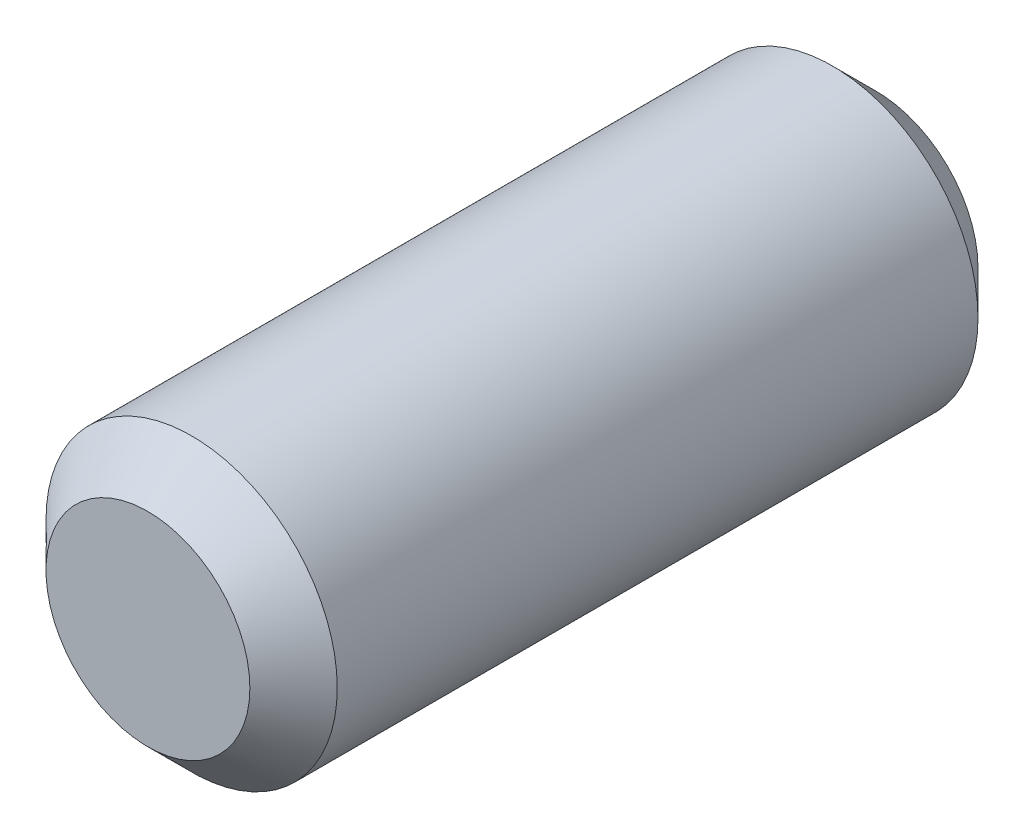
ISO-10303-21;
HEADER;
FILE_DESCRIPTION(('STEP AP214'),'2;1');
FILE_NAME('part.step','',(''),(''),'','','');
FILE_SCHEMA(('AUTOMOTIVE_DESIGN { 1 0 10303 214 1 1 1 1 }'));
ENDSEC;
DATA;
#1=APPLICATION_CONTEXT('core data for automotive mechanical design processes');
#2=APPLICATION_PROTOCOL_DEFINITION('international standard','automotive_design',2000,#1);
#3=PRODUCT_CONTEXT('',#1,'mechanical');
#4=PRODUCT('Part','Part','',(#3));
#5=PRODUCT_RELATED_PRODUCT_CATEGORY('part','',(#4));
#6=PRODUCT_DEFINITION_FORMATION('','',#4);
#7=PRODUCT_DEFINITION_CONTEXT('part definition',#1,'design');
#8=PRODUCT_DEFINITION('design','',#6,#7);
#9=PRODUCT_DEFINITION_SHAPE('','',#8);
#10=(LENGTH_UNIT() NAMED_UNIT(*) SI_UNIT(.MILLI.,.METRE.));
#11=(NAMED_UNIT(*) PLANE_ANGLE_UNIT() SI_UNIT($,.RADIAN.));
#12=(NAMED_UNIT(*) SI_UNIT($,.STERADIAN.) SOLID_ANGLE_UNIT());
#13=UNCERTAINTY_MEASURE_WITH_UNIT(LENGTH_MEASURE(1.E-05),#10,'distance_accuracy_value','');
#14=(GEOMETRIC_REPRESENTATION_CONTEXT(3) GLOBAL_UNCERTAINTY_ASSIGNED_CONTEXT((#13)) GLOBAL_UNIT_ASSIGNED_CONTEXT((#10,
#11,#12)) REPRESENTATION_CONTEXT('',''));
#15=CARTESIAN_POINT('',(0.,0.,0.));
#16=DIRECTION('',(0.,0.,1.));
#17=DIRECTION('',(1.,0.,0.));
#18=AXIS2_PLACEMENT_3D('',#15,#16,#17);
#19=CARTESIAN_POINT('',(0.,0.,5.));
#20=DIRECTION('',(0.,0.,-1.));
#21=DIRECTION('',(-1.,0.,0.));
#22=AXIS2_PLACEMENT_3D('',#19,#20,#21);
#23=CYLINDRICAL_SURFACE('',#22,1.);
#24=CARTESIAN_POINT('',(0.,0.,0.300000000000001));
#25=DIRECTION('',(0.,0.,1.));
#26=DIRECTION('',(1.,0.,0.));
#27=AXIS2_PLACEMENT_3D('',#24,#25,#26);
#28=CIRCLE('',#27,1.);
#29=CARTESIAN_POINT('',(1.,0.,0.300000000000001));
#30=VERTEX_POINT('',#29);
#31=EDGE_CURVE('E42',#30,#30,#28,.T.);
#32=ORIENTED_EDGE('',*,*,#31,.T.);
#33=EDGE_LOOP('',(#32));
#34=FACE_BOUND('',#33,.T.);
#35=CARTESIAN_POINT('',(0.,0.,4.7));
#36=DIRECTION('',(0.,0.,1.));
#37=DIRECTION('',(1.,0.,0.));
#38=AXIS2_PLACEMENT_3D('',#35,#36,#37);
#39=CIRCLE('',#38,1.);
#40=CARTESIAN_POINT('',(1.,0.,4.7));
#41=VERTEX_POINT('',#40);
#42=EDGE_CURVE('E46',#41,#41,#39,.F.);
#43=ORIENTED_EDGE('',*,*,#42,.T.);
#44=EDGE_LOOP('',(#43));
#45=FACE_BOUND('',#44,.T.);
#46=ADVANCED_FACE('F31',(#34,#45),#23,.T.);
#47=CARTESIAN_POINT('',(0.,0.,5.));
#48=DIRECTION('',(0.,0.,1.));
#49=DIRECTION('',(1.,0.,0.));
#50=AXIS2_PLACEMENT_3D('',#47,#48,#49);
#51=PLANE('',#50);
#52=CARTESIAN_POINT('',(0.,0.,5.));
#53=DIRECTION('',(0.,0.,1.));
#54=DIRECTION('',(1.,0.,0.));
#55=AXIS2_PLACEMENT_3D('',#52,#53,#54);
#56=CIRCLE('',#55,0.700000000000001);
#57=CARTESIAN_POINT('',(0.700000000000001,0.,5.));
#58=VERTEX_POINT('',#57);
#59=EDGE_CURVE('E10',#58,#58,#56,.T.);
#60=ORIENTED_EDGE('',*,*,#59,.T.);
#61=EDGE_LOOP('',(#60));
#62=FACE_BOUND('',#61,.T.);
#63=ADVANCED_FACE('F62',(#62),#51,.T.);
#64=CARTESIAN_POINT('',(0.,0.,0.));
#65=DIRECTION('',(0.,0.,1.));
#66=DIRECTION('',(1.,0.,0.));
#67=AXIS2_PLACEMENT_3D('',#64,#65,#66);
#68=PLANE('',#67);
#69=CARTESIAN_POINT('',(0.,0.,0.));
#70=DIRECTION('',(0.,0.,1.));
#71=DIRECTION('',(1.,0.,0.));
#72=AXIS2_PLACEMENT_3D('',#69,#70,#71);
#73=CIRCLE('',#72,0.699999999999998);
#74=CARTESIAN_POINT('',(0.699999999999998,0.,0.));
#75=VERTEX_POINT('',#74);
#76=EDGE_CURVE('E38',#75,#75,#73,.F.);
#77=ORIENTED_EDGE('',*,*,#76,.T.);
#78=EDGE_LOOP('',(#77));
#79=FACE_BOUND('',#78,.T.);
#80=ADVANCED_FACE('F59',(#79),#68,.F.);
#81=CARTESIAN_POINT('',(0.,0.,0.300000000000001));
#82=DIRECTION('',(0.,0.,1.));
#83=DIRECTION('',(1.,0.,0.));
#84=AXIS2_PLACEMENT_3D('',#81,#82,#83);
#85=CONICAL_SURFACE('',#84,1.,0.78539816339745);
#86=ORIENTED_EDGE('',*,*,#76,.F.);
#87=EDGE_LOOP('',(#86));
#88=FACE_BOUND('',#87,.T.);
#89=ORIENTED_EDGE('',*,*,#31,.F.);
#90=EDGE_LOOP('',(#89));
#91=FACE_BOUND('',#90,.T.);
#92=ADVANCED_FACE('F55',(#88,#91),#85,.T.);
#93=CARTESIAN_POINT('',(0.,0.,5.));
#94=DIRECTION('',(0.,0.,-1.));
#95=DIRECTION('',(-1.,0.,0.));
#96=AXIS2_PLACEMENT_3D('',#93,#94,#95);
#97=CONICAL_SURFACE('',#96,0.700000000000001,0.785398163397447);
#98=ORIENTED_EDGE('',*,*,#42,.F.);
#99=EDGE_LOOP('',(#98));
#100=FACE_BOUND('',#99,.T.);
#101=ORIENTED_EDGE('',*,*,#59,.F.);
#102=EDGE_LOOP('',(#101));
#103=FACE_BOUND('',#102,.T.);
#104=ADVANCED_FACE('F33',(#100,#103),#97,.T.);
#105=CLOSED_SHELL('',(#46,#63,#80,#92,#104));
#106=MANIFOLD_SOLID_BREP('B2',#105);
#107=ADVANCED_BREP_SHAPE_REPRESENTATION('',(#18,#106),#14);
#108=SHAPE_DEFINITION_REPRESENTATION(#9,#107);
ENDSEC;
END-ISO-10303-21;
